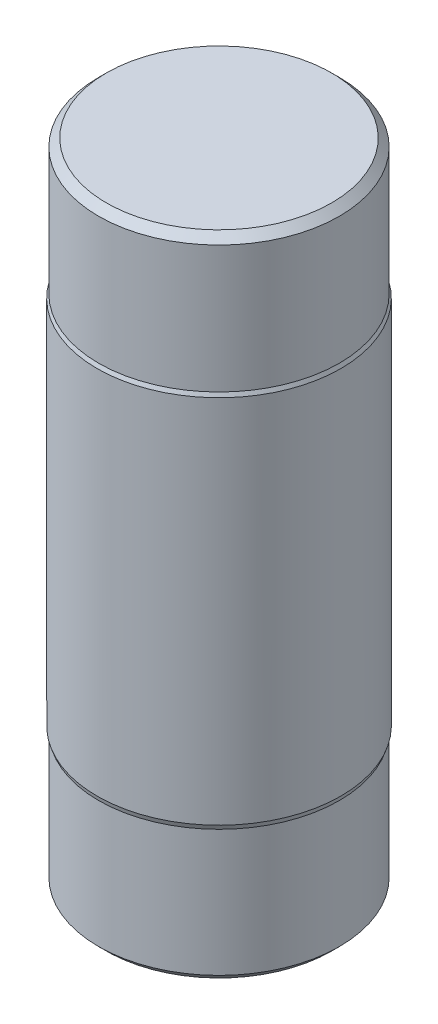
ISO-10303-21;
HEADER;
FILE_DESCRIPTION(('STEP AP214'),'2;1');
FILE_NAME('part.step','',(''),(''),'','','');
FILE_SCHEMA(('AUTOMOTIVE_DESIGN { 1 0 10303 214 1 1 1 1 }'));
ENDSEC;
DATA;
#1=APPLICATION_CONTEXT('core data for automotive mechanical design processes');
#2=APPLICATION_PROTOCOL_DEFINITION('international standard','automotive_design',2000,#1);
#3=PRODUCT_CONTEXT('',#1,'mechanical');
#4=PRODUCT('Part','Part','',(#3));
#5=PRODUCT_RELATED_PRODUCT_CATEGORY('part','',(#4));
#6=PRODUCT_DEFINITION_FORMATION('','',#4);
#7=PRODUCT_DEFINITION_CONTEXT('part definition',#1,'design');
#8=PRODUCT_DEFINITION('design','',#6,#7);
#9=PRODUCT_DEFINITION_SHAPE('','',#8);
#10=(LENGTH_UNIT() NAMED_UNIT(*) SI_UNIT(.MILLI.,.METRE.));
#11=(NAMED_UNIT(*) PLANE_ANGLE_UNIT() SI_UNIT($,.RADIAN.));
#12=(NAMED_UNIT(*) SI_UNIT($,.STERADIAN.) SOLID_ANGLE_UNIT());
#13=UNCERTAINTY_MEASURE_WITH_UNIT(LENGTH_MEASURE(1.E-05),#10,'distance_accuracy_value','');
#14=(GEOMETRIC_REPRESENTATION_CONTEXT(3) GLOBAL_UNCERTAINTY_ASSIGNED_CONTEXT((#13)) GLOBAL_UNIT_ASSIGNED_CONTEXT((#10,
#11,#12)) REPRESENTATION_CONTEXT('',''));
#15=CARTESIAN_POINT('',(0.,0.,0.));
#16=DIRECTION('',(0.,0.,1.));
#17=DIRECTION('',(1.,0.,0.));
#18=AXIS2_PLACEMENT_3D('',#15,#16,#17);
#19=CARTESIAN_POINT('',(0.,6.,0.));
#20=DIRECTION('',(0.,-1.,0.));
#21=DIRECTION('',(0.,0.,-1.));
#22=AXIS2_PLACEMENT_3D('',#19,#20,#21);
#23=CYLINDRICAL_SURFACE('',#22,3.95);
#24=CARTESIAN_POINT('',(0.,6.,0.));
#25=DIRECTION('',(0.,1.,0.));
#26=DIRECTION('',(0.,0.,1.));
#27=AXIS2_PLACEMENT_3D('',#24,#25,#26);
#28=CIRCLE('',#27,3.95);
#29=CARTESIAN_POINT('',(0.,6.,3.95));
#30=VERTEX_POINT('',#29);
#31=EDGE_CURVE('E57',#30,#30,#28,.T.);
#32=ORIENTED_EDGE('',*,*,#31,.F.);
#33=EDGE_LOOP('',(#32));
#34=FACE_BOUND('',#33,.T.);
#35=CARTESIAN_POINT('',(0.,-6.,0.));
#36=DIRECTION('',(0.,-1.,0.));
#37=DIRECTION('',(1.,0.,0.));
#38=AXIS2_PLACEMENT_3D('',#35,#36,#37);
#39=CIRCLE('',#38,3.95);
#40=CARTESIAN_POINT('',(3.95,-6.,0.));
#41=VERTEX_POINT('',#40);
#42=EDGE_CURVE('E60',#41,#41,#39,.T.);
#43=ORIENTED_EDGE('',*,*,#42,.F.);
#44=EDGE_LOOP('',(#43));
#45=FACE_BOUND('',#44,.T.);
#46=ADVANCED_FACE('F37',(#34,#45),#23,.T.);
#47=CARTESIAN_POINT('',(0.,-6.15,0.));
#48=DIRECTION('',(0.,1.,0.));
#49=DIRECTION('',(-1.,0.,0.));
#50=AXIS2_PLACEMENT_3D('',#47,#48,#49);
#51=CONICAL_SURFACE('',#50,3.9,0.321750554396646);
#52=ORIENTED_EDGE('',*,*,#42,.T.);
#53=EDGE_LOOP('',(#52));
#54=FACE_BOUND('',#53,.T.);
#55=CARTESIAN_POINT('',(0.,-6.15,0.));
#56=DIRECTION('',(0.,-1.,0.));
#57=DIRECTION('',(1.,0.,0.));
#58=AXIS2_PLACEMENT_3D('',#55,#56,#57);
#59=CIRCLE('',#58,3.9);
#60=CARTESIAN_POINT('',(3.9,-6.15,0.));
#61=VERTEX_POINT('',#60);
#62=EDGE_CURVE('E63',#61,#61,#59,.T.);
#63=ORIENTED_EDGE('',*,*,#62,.F.);
#64=EDGE_LOOP('',(#63));
#65=FACE_BOUND('',#64,.T.);
#66=ADVANCED_FACE('F86',(#54,#65),#51,.T.);
#67=CARTESIAN_POINT('',(0.,-10.5,0.));
#68=DIRECTION('',(0.,-1.,0.));
#69=DIRECTION('',(1.,0.,0.));
#70=AXIS2_PLACEMENT_3D('',#67,#68,#69);
#71=CYLINDRICAL_SURFACE('',#70,3.9);
#72=CARTESIAN_POINT('',(0.,-10.25,0.));
#73=DIRECTION('',(0.,1.,0.));
#74=DIRECTION('',(-1.,0.,0.));
#75=AXIS2_PLACEMENT_3D('',#72,#73,#74);
#76=CIRCLE('',#75,3.9);
#77=CARTESIAN_POINT('',(-3.9,-10.25,0.));
#78=VERTEX_POINT('',#77);
#79=EDGE_CURVE('E48',#78,#78,#76,.T.);
#80=ORIENTED_EDGE('',*,*,#79,.T.);
#81=EDGE_LOOP('',(#80));
#82=FACE_BOUND('',#81,.T.);
#83=ORIENTED_EDGE('',*,*,#62,.T.);
#84=EDGE_LOOP('',(#83));
#85=FACE_BOUND('',#84,.T.);
#86=ADVANCED_FACE('F92',(#82,#85),#71,.T.);
#87=CARTESIAN_POINT('',(0.,-10.5,0.));
#88=DIRECTION('',(0.,1.,0.));
#89=DIRECTION('',(-1.,0.,0.));
#90=AXIS2_PLACEMENT_3D('',#87,#88,#89);
#91=PLANE('',#90);
#92=CARTESIAN_POINT('',(0.,-10.5,0.));
#93=DIRECTION('',(0.,1.,0.));
#94=DIRECTION('',(-1.,0.,0.));
#95=AXIS2_PLACEMENT_3D('',#92,#93,#94);
#96=CIRCLE('',#95,3.65);
#97=CARTESIAN_POINT('',(-3.65,-10.5,0.));
#98=VERTEX_POINT('',#97);
#99=EDGE_CURVE('E52',#98,#98,#96,.F.);
#100=ORIENTED_EDGE('',*,*,#99,.T.);
#101=EDGE_LOOP('',(#100));
#102=FACE_BOUND('',#101,.T.);
#103=ADVANCED_FACE('F82',(#102),#91,.F.);
#104=CARTESIAN_POINT('',(0.,6.125,0.));
#105=DIRECTION('',(0.,-1.,0.));
#106=DIRECTION('',(1.,0.,0.));
#107=AXIS2_PLACEMENT_3D('',#104,#105,#106);
#108=CONICAL_SURFACE('',#107,3.90000000000001,0.380506377112336);
#109=ORIENTED_EDGE('',*,*,#31,.T.);
#110=EDGE_LOOP('',(#109));
#111=FACE_BOUND('',#110,.T.);
#112=CARTESIAN_POINT('',(0.,6.125,0.));
#113=DIRECTION('',(0.,-1.,0.));
#114=DIRECTION('',(1.,0.,0.));
#115=AXIS2_PLACEMENT_3D('',#112,#113,#114);
#116=CIRCLE('',#115,3.90000000000001);
#117=CARTESIAN_POINT('',(3.9,6.125,0.));
#118=VERTEX_POINT('',#117);
#119=EDGE_CURVE('E66',#118,#118,#116,.T.);
#120=ORIENTED_EDGE('',*,*,#119,.T.);
#121=EDGE_LOOP('',(#120));
#122=FACE_BOUND('',#121,.T.);
#123=ADVANCED_FACE('F70',(#111,#122),#108,.T.);
#124=CARTESIAN_POINT('',(0.,-10.5,0.));
#125=DIRECTION('',(0.,-1.,0.));
#126=DIRECTION('',(1.,0.,0.));
#127=AXIS2_PLACEMENT_3D('',#124,#125,#126);
#128=CYLINDRICAL_SURFACE('',#127,3.90000000000001);
#129=CARTESIAN_POINT('',(0.,10.25,0.));
#130=DIRECTION('',(0.,-1.,0.));
#131=DIRECTION('',(1.,0.,0.));
#132=AXIS2_PLACEMENT_3D('',#129,#130,#131);
#133=CIRCLE('',#132,3.90000000000001);
#134=CARTESIAN_POINT('',(3.9,10.25,0.));
#135=VERTEX_POINT('',#134);
#136=EDGE_CURVE('E44',#135,#135,#133,.T.);
#137=ORIENTED_EDGE('',*,*,#136,.T.);
#138=EDGE_LOOP('',(#137));
#139=FACE_BOUND('',#138,.T.);
#140=ORIENTED_EDGE('',*,*,#119,.F.);
#141=EDGE_LOOP('',(#140));
#142=FACE_BOUND('',#141,.T.);
#143=ADVANCED_FACE('F72',(#139,#142),#128,.T.);
#144=CARTESIAN_POINT('',(0.,10.5,0.));
#145=DIRECTION('',(0.,-1.,0.));
#146=DIRECTION('',(1.,0.,0.));
#147=AXIS2_PLACEMENT_3D('',#144,#145,#146);
#148=PLANE('',#147);
#149=CARTESIAN_POINT('',(0.,10.5,0.));
#150=DIRECTION('',(0.,-1.,0.));
#151=DIRECTION('',(1.,0.,0.));
#152=AXIS2_PLACEMENT_3D('',#149,#150,#151);
#153=CIRCLE('',#152,3.65000000000001);
#154=CARTESIAN_POINT('',(3.65,10.5,0.));
#155=VERTEX_POINT('',#154);
#156=EDGE_CURVE('E10',#155,#155,#153,.F.);
#157=ORIENTED_EDGE('',*,*,#156,.T.);
#158=EDGE_LOOP('',(#157));
#159=FACE_BOUND('',#158,.T.);
#160=ADVANCED_FACE('F74',(#159),#148,.F.);
#161=CARTESIAN_POINT('',(0.,-10.5,0.));
#162=DIRECTION('',(0.,1.,0.));
#163=DIRECTION('',(-1.,0.,0.));
#164=AXIS2_PLACEMENT_3D('',#161,#162,#163);
#165=CONICAL_SURFACE('',#164,3.65,0.785398163397444);
#166=ORIENTED_EDGE('',*,*,#79,.F.);
#167=EDGE_LOOP('',(#166));
#168=FACE_BOUND('',#167,.T.);
#169=ORIENTED_EDGE('',*,*,#99,.F.);
#170=EDGE_LOOP('',(#169));
#171=FACE_BOUND('',#170,.T.);
#172=ADVANCED_FACE('F80',(#168,#171),#165,.T.);
#173=CARTESIAN_POINT('',(0.,10.25,0.));
#174=DIRECTION('',(0.,-1.,0.));
#175=DIRECTION('',(1.,0.,0.));
#176=AXIS2_PLACEMENT_3D('',#173,#174,#175);
#177=CONICAL_SURFACE('',#176,3.90000000000001,0.785398163397449);
#178=ORIENTED_EDGE('',*,*,#156,.F.);
#179=EDGE_LOOP('',(#178));
#180=FACE_BOUND('',#179,.T.);
#181=ORIENTED_EDGE('',*,*,#136,.F.);
#182=EDGE_LOOP('',(#181));
#183=FACE_BOUND('',#182,.T.);
#184=ADVANCED_FACE('F39',(#180,#183),#177,.T.);
#185=CLOSED_SHELL('',(#46,#66,#86,#103,#123,#143,#160,#172,#184));
#186=MANIFOLD_SOLID_BREP('B2',#185);
#187=ADVANCED_BREP_SHAPE_REPRESENTATION('',(#18,#186),#14);
#188=SHAPE_DEFINITION_REPRESENTATION(#9,#187);
ENDSEC;
END-ISO-10303-21;
